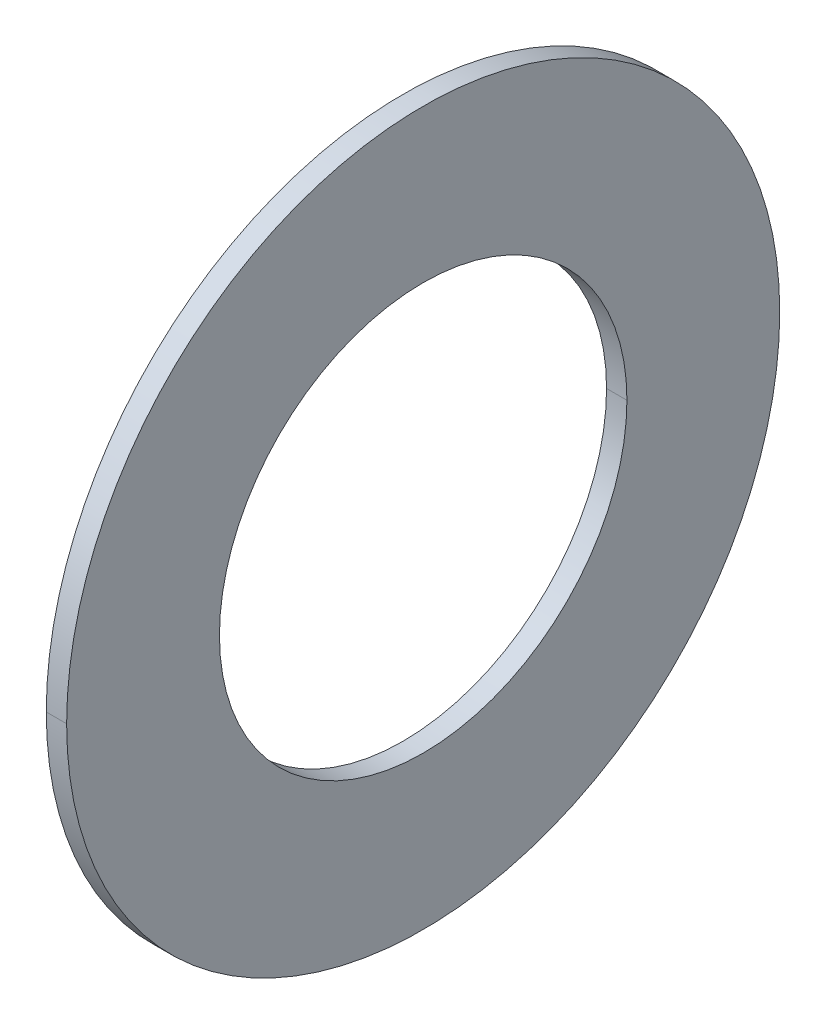
ISO-10303-21;
HEADER;
FILE_DESCRIPTION(('STEP AP214'),'2;1');
FILE_NAME('part.step','',(''),(''),'','','');
FILE_SCHEMA(('AUTOMOTIVE_DESIGN { 1 0 10303 214 1 1 1 1 }'));
ENDSEC;
DATA;
#1=APPLICATION_CONTEXT('core data for automotive mechanical design processes');
#2=APPLICATION_PROTOCOL_DEFINITION('international standard','automotive_design',2000,#1);
#3=PRODUCT_CONTEXT('',#1,'mechanical');
#4=PRODUCT('Part','Part','',(#3));
#5=PRODUCT_RELATED_PRODUCT_CATEGORY('part','',(#4));
#6=PRODUCT_DEFINITION_FORMATION('','',#4);
#7=PRODUCT_DEFINITION_CONTEXT('part definition',#1,'design');
#8=PRODUCT_DEFINITION('design','',#6,#7);
#9=PRODUCT_DEFINITION_SHAPE('','',#8);
#10=(LENGTH_UNIT() NAMED_UNIT(*) SI_UNIT(.MILLI.,.METRE.));
#11=(NAMED_UNIT(*) PLANE_ANGLE_UNIT() SI_UNIT($,.RADIAN.));
#12=(NAMED_UNIT(*) SI_UNIT($,.STERADIAN.) SOLID_ANGLE_UNIT());
#13=UNCERTAINTY_MEASURE_WITH_UNIT(LENGTH_MEASURE(1.E-05),#10,'distance_accuracy_value','');
#14=(GEOMETRIC_REPRESENTATION_CONTEXT(3) GLOBAL_UNCERTAINTY_ASSIGNED_CONTEXT((#13)) GLOBAL_UNIT_ASSIGNED_CONTEXT((#10,
#11,#12)) REPRESENTATION_CONTEXT('',''));
#15=CARTESIAN_POINT('',(0.,0.,0.));
#16=DIRECTION('',(0.,0.,1.));
#17=DIRECTION('',(1.,0.,0.));
#18=AXIS2_PLACEMENT_3D('',#15,#16,#17);
#19=CARTESIAN_POINT('',(1.,17.5,0.));
#20=DIRECTION('',(-1.,0.,0.));
#21=DIRECTION('',(0.,0.,1.));
#22=AXIS2_PLACEMENT_3D('',#19,#20,#21);
#23=PLANE('',#22);
#24=CARTESIAN_POINT('',(1.,0.,0.));
#25=DIRECTION('',(1.,0.,0.));
#26=DIRECTION('',(0.,0.,-1.));
#27=AXIS2_PLACEMENT_3D('',#24,#25,#26);
#28=CIRCLE('',#27,10.);
#29=CARTESIAN_POINT('',(1.,0.,-10.));
#30=VERTEX_POINT('',#29);
#31=CARTESIAN_POINT('',(1.,0.,10.));
#32=VERTEX_POINT('',#31);
#33=EDGE_CURVE('E11',#30,#32,#28,.T.);
#34=ORIENTED_EDGE('',*,*,#33,.T.);
#35=CARTESIAN_POINT('',(1.,0.,0.));
#36=DIRECTION('',(1.,0.,0.));
#37=DIRECTION('',(0.,0.,-1.));
#38=AXIS2_PLACEMENT_3D('',#35,#36,#37);
#39=CIRCLE('',#38,10.);
#40=EDGE_CURVE('E25',#32,#30,#39,.T.);
#41=ORIENTED_EDGE('',*,*,#40,.T.);
#42=EDGE_LOOP('',(#34,#41));
#43=FACE_BOUND('',#42,.T.);
#44=CARTESIAN_POINT('',(1.,0.,0.));
#45=DIRECTION('',(1.,0.,0.));
#46=DIRECTION('',(0.,0.,-1.));
#47=AXIS2_PLACEMENT_3D('',#44,#45,#46);
#48=CIRCLE('',#47,17.5);
#49=CARTESIAN_POINT('',(1.,0.,17.5));
#50=VERTEX_POINT('',#49);
#51=CARTESIAN_POINT('',(1.,0.,-17.5));
#52=VERTEX_POINT('',#51);
#53=EDGE_CURVE('E95',#50,#52,#48,.T.);
#54=ORIENTED_EDGE('',*,*,#53,.F.);
#55=CARTESIAN_POINT('',(1.,0.,0.));
#56=DIRECTION('',(1.,0.,0.));
#57=DIRECTION('',(0.,0.,-1.));
#58=AXIS2_PLACEMENT_3D('',#55,#56,#57);
#59=CIRCLE('',#58,17.5);
#60=EDGE_CURVE('E90',#52,#50,#59,.T.);
#61=ORIENTED_EDGE('',*,*,#60,.F.);
#62=EDGE_LOOP('',(#54,#61));
#63=FACE_BOUND('',#62,.T.);
#64=ADVANCED_FACE('F17',(#43,#63),#23,.T.);
#65=CARTESIAN_POINT('',(50.,0.,0.));
#66=DIRECTION('',(1.,0.,0.));
#67=DIRECTION('',(0.,-1.,0.));
#68=AXIS2_PLACEMENT_3D('',#65,#66,#67);
#69=CYLINDRICAL_SURFACE('',#68,17.5);
#70=DIRECTION('',(1.,0.,0.));
#71=VECTOR('',#70,1.);
#72=CARTESIAN_POINT('',(1.,0.,17.5));
#73=LINE('',#72,#71);
#74=CARTESIAN_POINT('',(2.,0.,17.5));
#75=VERTEX_POINT('',#74);
#76=EDGE_CURVE('E86',#50,#75,#73,.T.);
#77=ORIENTED_EDGE('',*,*,#76,.T.);
#78=CARTESIAN_POINT('',(2.,0.,0.));
#79=DIRECTION('',(1.,0.,0.));
#80=DIRECTION('',(0.,0.,-1.));
#81=AXIS2_PLACEMENT_3D('',#78,#79,#80);
#82=CIRCLE('',#81,17.5);
#83=CARTESIAN_POINT('',(2.,0.,-17.5));
#84=VERTEX_POINT('',#83);
#85=EDGE_CURVE('E81',#84,#75,#82,.T.);
#86=ORIENTED_EDGE('',*,*,#85,.F.);
#87=DIRECTION('',(1.,0.,0.));
#88=VECTOR('',#87,1.);
#89=CARTESIAN_POINT('',(1.,0.,-17.5));
#90=LINE('',#89,#88);
#91=EDGE_CURVE('E70',#52,#84,#90,.T.);
#92=ORIENTED_EDGE('',*,*,#91,.F.);
#93=ORIENTED_EDGE('',*,*,#60,.T.);
#94=EDGE_LOOP('',(#77,#86,#92,#93));
#95=FACE_BOUND('',#94,.T.);
#96=ADVANCED_FACE('F111',(#95),#69,.T.);
#97=CARTESIAN_POINT('',(50.,0.,0.));
#98=DIRECTION('',(1.,0.,0.));
#99=DIRECTION('',(0.,1.,0.));
#100=AXIS2_PLACEMENT_3D('',#97,#98,#99);
#101=CYLINDRICAL_SURFACE('',#100,17.5);
#102=ORIENTED_EDGE('',*,*,#76,.F.);
#103=ORIENTED_EDGE('',*,*,#53,.T.);
#104=ORIENTED_EDGE('',*,*,#91,.T.);
#105=CARTESIAN_POINT('',(2.,0.,0.));
#106=DIRECTION('',(1.,0.,0.));
#107=DIRECTION('',(0.,0.,-1.));
#108=AXIS2_PLACEMENT_3D('',#105,#106,#107);
#109=CIRCLE('',#108,17.5);
#110=EDGE_CURVE('E67',#75,#84,#109,.T.);
#111=ORIENTED_EDGE('',*,*,#110,.F.);
#112=EDGE_LOOP('',(#102,#103,#104,#111));
#113=FACE_BOUND('',#112,.T.);
#114=ADVANCED_FACE('F106',(#113),#101,.T.);
#115=CARTESIAN_POINT('',(2.,10.,0.));
#116=DIRECTION('',(1.,0.,0.));
#117=DIRECTION('',(0.,0.,-1.));
#118=AXIS2_PLACEMENT_3D('',#115,#116,#117);
#119=PLANE('',#118);
#120=ORIENTED_EDGE('',*,*,#85,.T.);
#121=ORIENTED_EDGE('',*,*,#110,.T.);
#122=EDGE_LOOP('',(#120,#121));
#123=FACE_BOUND('',#122,.T.);
#124=CARTESIAN_POINT('',(2.,0.,0.));
#125=DIRECTION('',(1.,0.,0.));
#126=DIRECTION('',(0.,0.,-1.));
#127=AXIS2_PLACEMENT_3D('',#124,#125,#126);
#128=CIRCLE('',#127,10.);
#129=CARTESIAN_POINT('',(2.,0.,10.));
#130=VERTEX_POINT('',#129);
#131=CARTESIAN_POINT('',(2.,0.,-10.));
#132=VERTEX_POINT('',#131);
#133=EDGE_CURVE('E55',#130,#132,#128,.T.);
#134=ORIENTED_EDGE('',*,*,#133,.F.);
#135=CARTESIAN_POINT('',(2.,0.,0.));
#136=DIRECTION('',(1.,0.,0.));
#137=DIRECTION('',(0.,0.,-1.));
#138=AXIS2_PLACEMENT_3D('',#135,#136,#137);
#139=CIRCLE('',#138,10.);
#140=EDGE_CURVE('E51',#132,#130,#139,.T.);
#141=ORIENTED_EDGE('',*,*,#140,.F.);
#142=EDGE_LOOP('',(#134,#141));
#143=FACE_BOUND('',#142,.T.);
#144=ADVANCED_FACE('F53',(#123,#143),#119,.T.);
#145=CARTESIAN_POINT('',(50.,0.,0.));
#146=DIRECTION('',(1.,0.,0.));
#147=DIRECTION('',(0.,-1.,0.));
#148=AXIS2_PLACEMENT_3D('',#145,#146,#147);
#149=CYLINDRICAL_SURFACE('',#148,10.);
#150=DIRECTION('',(1.,0.,0.));
#151=VECTOR('',#150,1.);
#152=CARTESIAN_POINT('',(1.,0.,10.));
#153=LINE('',#152,#151);
#154=EDGE_CURVE('E59',#32,#130,#153,.T.);
#155=ORIENTED_EDGE('',*,*,#154,.F.);
#156=ORIENTED_EDGE('',*,*,#33,.F.);
#157=DIRECTION('',(1.,0.,0.));
#158=VECTOR('',#157,1.);
#159=CARTESIAN_POINT('',(1.,0.,-10.));
#160=LINE('',#159,#158);
#161=EDGE_CURVE('E62',#30,#132,#160,.T.);
#162=ORIENTED_EDGE('',*,*,#161,.T.);
#163=ORIENTED_EDGE('',*,*,#140,.T.);
#164=EDGE_LOOP('',(#155,#156,#162,#163));
#165=FACE_BOUND('',#164,.T.);
#166=ADVANCED_FACE('F63',(#165),#149,.F.);
#167=CARTESIAN_POINT('',(50.,0.,0.));
#168=DIRECTION('',(1.,0.,0.));
#169=DIRECTION('',(0.,1.,0.));
#170=AXIS2_PLACEMENT_3D('',#167,#168,#169);
#171=CYLINDRICAL_SURFACE('',#170,10.);
#172=ORIENTED_EDGE('',*,*,#154,.T.);
#173=ORIENTED_EDGE('',*,*,#133,.T.);
#174=ORIENTED_EDGE('',*,*,#161,.F.);
#175=ORIENTED_EDGE('',*,*,#40,.F.);
#176=EDGE_LOOP('',(#172,#173,#174,#175));
#177=FACE_BOUND('',#176,.T.);
#178=ADVANCED_FACE('F66',(#177),#171,.F.);
#179=CLOSED_SHELL('',(#64,#96,#114,#144,#166,#178));
#180=MANIFOLD_SOLID_BREP('B1',#179);
#181=ADVANCED_BREP_SHAPE_REPRESENTATION('',(#18,#180),#14);
#182=SHAPE_DEFINITION_REPRESENTATION(#9,#181);
ENDSEC;
END-ISO-10303-21;
